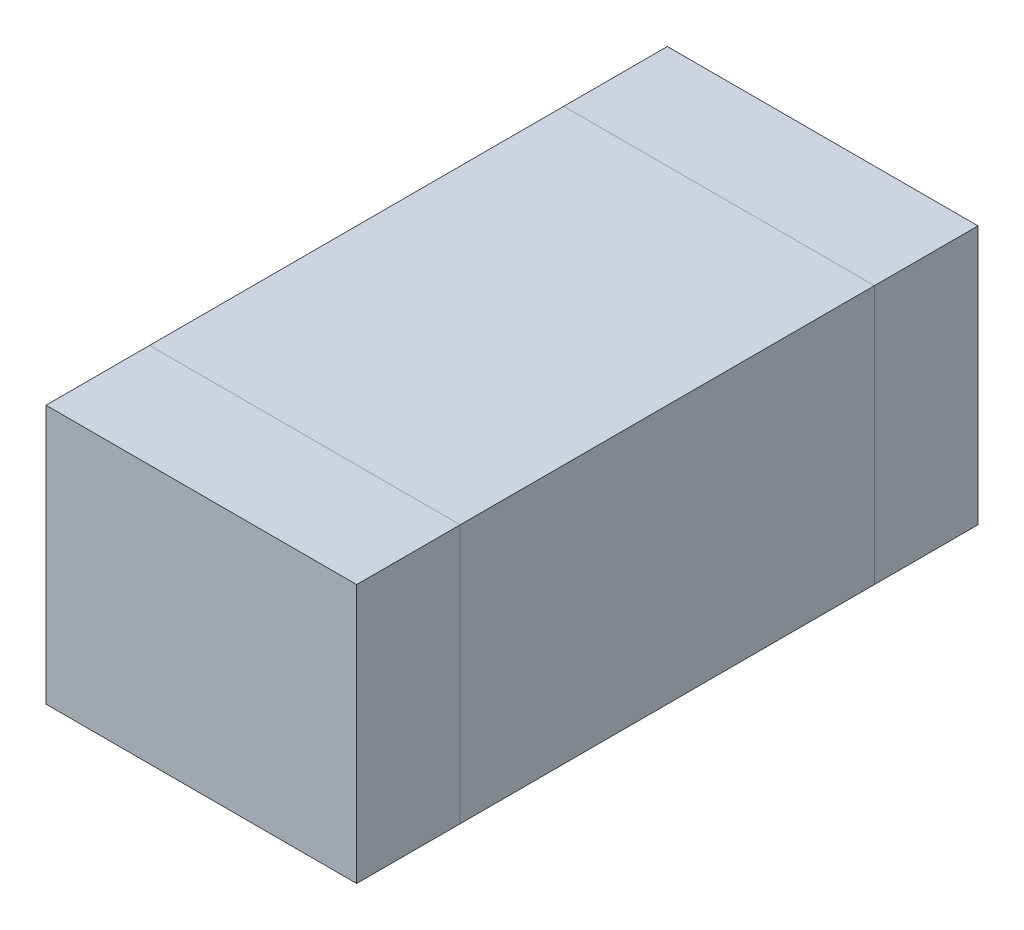
ISO-10303-21;
HEADER;
FILE_DESCRIPTION(('STEP AP214'),'2;1');
FILE_NAME('part.step','',(''),(''),'','','');
FILE_SCHEMA(('AUTOMOTIVE_DESIGN { 1 0 10303 214 1 1 1 1 }'));
ENDSEC;
DATA;
#1=APPLICATION_CONTEXT('core data for automotive mechanical design processes');
#2=APPLICATION_PROTOCOL_DEFINITION('international standard','automotive_design',2000,#1);
#3=PRODUCT_CONTEXT('',#1,'mechanical');
#4=PRODUCT('Part','Part','',(#3));
#5=PRODUCT_RELATED_PRODUCT_CATEGORY('part','',(#4));
#6=PRODUCT_DEFINITION_FORMATION('','',#4);
#7=PRODUCT_DEFINITION_CONTEXT('part definition',#1,'design');
#8=PRODUCT_DEFINITION('design','',#6,#7);
#9=PRODUCT_DEFINITION_SHAPE('','',#8);
#10=(LENGTH_UNIT() NAMED_UNIT(*) SI_UNIT(.MILLI.,.METRE.));
#11=(NAMED_UNIT(*) PLANE_ANGLE_UNIT() SI_UNIT($,.RADIAN.));
#12=(NAMED_UNIT(*) SI_UNIT($,.STERADIAN.) SOLID_ANGLE_UNIT());
#13=UNCERTAINTY_MEASURE_WITH_UNIT(LENGTH_MEASURE(1.E-05),#10,'distance_accuracy_value','');
#14=(GEOMETRIC_REPRESENTATION_CONTEXT(3) GLOBAL_UNCERTAINTY_ASSIGNED_CONTEXT((#13)) GLOBAL_UNIT_ASSIGNED_CONTEXT((#10,
#11,#12)) REPRESENTATION_CONTEXT('',''));
#15=CARTESIAN_POINT('',(0.,0.,0.));
#16=DIRECTION('',(0.,0.,1.));
#17=DIRECTION('',(1.,0.,0.));
#18=AXIS2_PLACEMENT_3D('',#15,#16,#17);
#19=CARTESIAN_POINT('',(-0.15,0.566227766016838,0.3));
#20=DIRECTION('',(0.,0.,1.));
#21=DIRECTION('',(1.,0.,0.));
#22=AXIS2_PLACEMENT_3D('',#19,#20,#21);
#23=PLANE('',#22);
#24=DIRECTION('',(0.,1.,0.));
#25=VECTOR('',#24,1.);
#26=CARTESIAN_POINT('',(-0.15,0.566227766016838,0.3));
#27=LINE('',#26,#25);
#28=CARTESIAN_POINT('',(-0.15,0.,0.3));
#29=VERTEX_POINT('',#28);
#30=CARTESIAN_POINT('',(-0.15,0.25,0.3));
#31=VERTEX_POINT('',#30);
#32=EDGE_CURVE('P0_E20',#29,#31,#27,.T.);
#33=ORIENTED_EDGE('',*,*,#32,.F.);
#34=DIRECTION('',(1.,0.,0.));
#35=VECTOR('',#34,1.);
#36=CARTESIAN_POINT('',(0.,0.,0.3));
#37=LINE('',#36,#35);
#38=CARTESIAN_POINT('',(0.15,0.,0.3));
#39=VERTEX_POINT('',#38);
#40=EDGE_CURVE('P0_E79',#29,#39,#37,.T.);
#41=ORIENTED_EDGE('',*,*,#40,.T.);
#42=DIRECTION('',(0.,1.,0.));
#43=VECTOR('',#42,1.);
#44=CARTESIAN_POINT('',(0.15,0.566227766016838,0.3));
#45=LINE('',#44,#43);
#46=CARTESIAN_POINT('',(0.15,0.25,0.3));
#47=VERTEX_POINT('',#46);
#48=EDGE_CURVE('P0_E68',#47,#39,#45,.F.);
#49=ORIENTED_EDGE('',*,*,#48,.F.);
#50=DIRECTION('',(1.,0.,0.));
#51=VECTOR('',#50,1.);
#52=CARTESIAN_POINT('',(0.,0.25,0.3));
#53=LINE('',#52,#51);
#54=EDGE_CURVE('P0_E56',#31,#47,#53,.T.);
#55=ORIENTED_EDGE('',*,*,#54,.F.);
#56=EDGE_LOOP('',(#33,#41,#49,#55));
#57=FACE_BOUND('',#56,.T.);
#58=ADVANCED_FACE('P0_F17',(#57),#23,.T.);
#59=CARTESIAN_POINT('',(-0.15,0.566227766016838,0.2));
#60=DIRECTION('',(-1.,0.,0.));
#61=DIRECTION('',(0.,0.,1.));
#62=AXIS2_PLACEMENT_3D('',#59,#60,#61);
#63=PLANE('',#62);
#64=DIRECTION('',(0.,1.,0.));
#65=VECTOR('',#64,1.);
#66=CARTESIAN_POINT('',(-0.15,0.566227766016838,0.2));
#67=LINE('',#66,#65);
#68=CARTESIAN_POINT('',(-0.15,0.,0.2));
#69=VERTEX_POINT('',#68);
#70=CARTESIAN_POINT('',(-0.15,0.25,0.2));
#71=VERTEX_POINT('',#70);
#72=EDGE_CURVE('P0_E83',#69,#71,#67,.T.);
#73=ORIENTED_EDGE('',*,*,#72,.F.);
#74=DIRECTION('',(0.,0.,1.));
#75=VECTOR('',#74,1.);
#76=CARTESIAN_POINT('',(-0.15,0.,0.));
#77=LINE('',#76,#75);
#78=EDGE_CURVE('P0_E65',#69,#29,#77,.T.);
#79=ORIENTED_EDGE('',*,*,#78,.T.);
#80=ORIENTED_EDGE('',*,*,#32,.T.);
#81=DIRECTION('',(0.,0.,1.));
#82=VECTOR('',#81,1.);
#83=CARTESIAN_POINT('',(-0.15,0.25,0.));
#84=LINE('',#83,#82);
#85=EDGE_CURVE('P0_E62',#71,#31,#84,.T.);
#86=ORIENTED_EDGE('',*,*,#85,.F.);
#87=EDGE_LOOP('',(#73,#79,#80,#86));
#88=FACE_BOUND('',#87,.T.);
#89=ADVANCED_FACE('P0_F61',(#88),#63,.T.);
#90=CARTESIAN_POINT('',(0.,0.25,0.));
#91=DIRECTION('',(0.,1.,0.));
#92=DIRECTION('',(0.,0.,1.));
#93=AXIS2_PLACEMENT_3D('',#90,#91,#92);
#94=PLANE('',#93);
#95=DIRECTION('',(0.,0.,-1.));
#96=VECTOR('',#95,1.);
#97=CARTESIAN_POINT('',(0.15,0.25,0.2));
#98=LINE('',#97,#96);
#99=CARTESIAN_POINT('',(0.15,0.25,0.2));
#100=VERTEX_POINT('',#99);
#101=EDGE_CURVE('P0_E70',#100,#47,#98,.F.);
#102=ORIENTED_EDGE('',*,*,#101,.F.);
#103=DIRECTION('',(-1.,0.,0.));
#104=VECTOR('',#103,1.);
#105=CARTESIAN_POINT('',(-0.15,0.25,0.2));
#106=LINE('',#105,#104);
#107=EDGE_CURVE('P0_E74',#71,#100,#106,.F.);
#108=ORIENTED_EDGE('',*,*,#107,.F.);
#109=ORIENTED_EDGE('',*,*,#85,.T.);
#110=ORIENTED_EDGE('',*,*,#54,.T.);
#111=EDGE_LOOP('',(#102,#108,#109,#110));
#112=FACE_BOUND('',#111,.T.);
#113=ADVANCED_FACE('P0_F72',(#112),#94,.T.);
#114=CARTESIAN_POINT('',(0.15,0.566227766016838,0.2));
#115=DIRECTION('',(1.,0.,0.));
#116=DIRECTION('',(0.,0.,-1.));
#117=AXIS2_PLACEMENT_3D('',#114,#115,#116);
#118=PLANE('',#117);
#119=ORIENTED_EDGE('',*,*,#48,.T.);
#120=DIRECTION('',(0.,0.,1.));
#121=VECTOR('',#120,1.);
#122=CARTESIAN_POINT('',(0.15,0.,0.));
#123=LINE('',#122,#121);
#124=CARTESIAN_POINT('',(0.15,0.,0.2));
#125=VERTEX_POINT('',#124);
#126=EDGE_CURVE('P0_E35',#39,#125,#123,.F.);
#127=ORIENTED_EDGE('',*,*,#126,.T.);
#128=DIRECTION('',(0.,1.,0.));
#129=VECTOR('',#128,1.);
#130=CARTESIAN_POINT('',(0.15,0.566227766016838,0.2));
#131=LINE('',#130,#129);
#132=EDGE_CURVE('P0_E26',#100,#125,#131,.F.);
#133=ORIENTED_EDGE('',*,*,#132,.F.);
#134=ORIENTED_EDGE('',*,*,#101,.T.);
#135=EDGE_LOOP('',(#119,#127,#133,#134));
#136=FACE_BOUND('',#135,.T.);
#137=ADVANCED_FACE('P0_F89',(#136),#118,.T.);
#138=CARTESIAN_POINT('',(0.,0.,0.));
#139=DIRECTION('',(0.,1.,0.));
#140=DIRECTION('',(0.,0.,1.));
#141=AXIS2_PLACEMENT_3D('',#138,#139,#140);
#142=PLANE('',#141);
#143=DIRECTION('',(-1.,0.,0.));
#144=VECTOR('',#143,1.);
#145=CARTESIAN_POINT('',(-0.15,0.,0.2));
#146=LINE('',#145,#144);
#147=EDGE_CURVE('P0_E11',#125,#69,#146,.T.);
#148=ORIENTED_EDGE('',*,*,#147,.F.);
#149=ORIENTED_EDGE('',*,*,#126,.F.);
#150=ORIENTED_EDGE('',*,*,#40,.F.);
#151=ORIENTED_EDGE('',*,*,#78,.F.);
#152=EDGE_LOOP('',(#148,#149,#150,#151));
#153=FACE_BOUND('',#152,.T.);
#154=ADVANCED_FACE('P0_F91',(#153),#142,.F.);
#155=CARTESIAN_POINT('',(-0.15,0.566227766016838,0.2));
#156=DIRECTION('',(0.,0.,-1.));
#157=DIRECTION('',(-1.,0.,0.));
#158=AXIS2_PLACEMENT_3D('',#155,#156,#157);
#159=PLANE('',#158);
#160=ORIENTED_EDGE('',*,*,#132,.T.);
#161=ORIENTED_EDGE('',*,*,#147,.T.);
#162=ORIENTED_EDGE('',*,*,#72,.T.);
#163=ORIENTED_EDGE('',*,*,#107,.T.);
#164=EDGE_LOOP('',(#160,#161,#162,#163));
#165=FACE_BOUND('',#164,.T.);
#166=ADVANCED_FACE('P0_F88',(#165),#159,.T.);
#167=CLOSED_SHELL('',(#58,#89,#113,#137,#154,#166));
#168=MANIFOLD_SOLID_BREP('P0_B1',#167);
#169=CARTESIAN_POINT('',(0.,0.,0.));
#170=DIRECTION('',(0.,1.,0.));
#171=DIRECTION('',(0.,0.,1.));
#172=AXIS2_PLACEMENT_3D('',#169,#170,#171);
#173=PLANE('',#172);
#174=DIRECTION('',(-1.,0.,0.));
#175=VECTOR('',#174,1.);
#176=CARTESIAN_POINT('',(-0.15,0.,0.2));
#177=LINE('',#176,#175);
#178=CARTESIAN_POINT('',(0.15,0.,0.2));
#179=VERTEX_POINT('',#178);
#180=CARTESIAN_POINT('',(-0.15,0.,0.2));
#181=VERTEX_POINT('',#180);
#182=EDGE_CURVE('P1_E81',#179,#181,#177,.T.);
#183=ORIENTED_EDGE('',*,*,#182,.T.);
#184=DIRECTION('',(0.,0.,-1.));
#185=VECTOR('',#184,1.);
#186=CARTESIAN_POINT('',(-0.15,0.,-0.2));
#187=LINE('',#186,#185);
#188=CARTESIAN_POINT('',(-0.15,0.,-0.2));
#189=VERTEX_POINT('',#188);
#190=EDGE_CURVE('P1_E68',#181,#189,#187,.T.);
#191=ORIENTED_EDGE('',*,*,#190,.T.);
#192=DIRECTION('',(1.,0.,0.));
#193=VECTOR('',#192,1.);
#194=CARTESIAN_POINT('',(-0.15,0.,-0.2));
#195=LINE('',#194,#193);
#196=CARTESIAN_POINT('',(0.15,0.,-0.2));
#197=VERTEX_POINT('',#196);
#198=EDGE_CURVE('P1_E55',#189,#197,#195,.T.);
#199=ORIENTED_EDGE('',*,*,#198,.T.);
#200=DIRECTION('',(0.,0.,1.));
#201=VECTOR('',#200,1.);
#202=CARTESIAN_POINT('',(0.15,0.,-0.2));
#203=LINE('',#202,#201);
#204=EDGE_CURVE('P1_E20',#197,#179,#203,.T.);
#205=ORIENTED_EDGE('',*,*,#204,.T.);
#206=EDGE_LOOP('',(#183,#191,#199,#205));
#207=FACE_BOUND('',#206,.T.);
#208=ADVANCED_FACE('P1_F17',(#207),#173,.F.);
#209=CARTESIAN_POINT('',(0.15,0.25,-0.2));
#210=DIRECTION('',(-1.,0.,0.));
#211=DIRECTION('',(0.,0.,1.));
#212=AXIS2_PLACEMENT_3D('',#209,#210,#211);
#213=PLANE('',#212);
#214=DIRECTION('',(0.,1.,0.));
#215=VECTOR('',#214,1.);
#216=CARTESIAN_POINT('',(0.15,0.25,-0.2));
#217=LINE('',#216,#215);
#218=CARTESIAN_POINT('',(0.15,0.25,-0.2));
#219=VERTEX_POINT('',#218);
#220=EDGE_CURVE('P1_E61',#197,#219,#217,.T.);
#221=ORIENTED_EDGE('',*,*,#220,.T.);
#222=DIRECTION('',(0.,0.,1.));
#223=VECTOR('',#222,1.);
#224=CARTESIAN_POINT('',(0.15,0.25,0.));
#225=LINE('',#224,#223);
#226=CARTESIAN_POINT('',(0.15,0.25,0.2));
#227=VERTEX_POINT('',#226);
#228=EDGE_CURVE('P1_E83',#227,#219,#225,.F.);
#229=ORIENTED_EDGE('',*,*,#228,.F.);
#230=DIRECTION('',(0.,1.,0.));
#231=VECTOR('',#230,1.);
#232=CARTESIAN_POINT('',(0.15,0.25,0.2));
#233=LINE('',#232,#231);
#234=EDGE_CURVE('P1_E64',#227,#179,#233,.F.);
#235=ORIENTED_EDGE('',*,*,#234,.T.);
#236=ORIENTED_EDGE('',*,*,#204,.F.);
#237=EDGE_LOOP('',(#221,#229,#235,#236));
#238=FACE_BOUND('',#237,.T.);
#239=ADVANCED_FACE('P1_F60',(#238),#213,.F.);
#240=CARTESIAN_POINT('',(-0.15,0.25,-0.2));
#241=DIRECTION('',(0.,0.,1.));
#242=DIRECTION('',(1.,0.,0.));
#243=AXIS2_PLACEMENT_3D('',#240,#241,#242);
#244=PLANE('',#243);
#245=DIRECTION('',(0.,1.,0.));
#246=VECTOR('',#245,1.);
#247=CARTESIAN_POINT('',(-0.15,0.25,-0.2));
#248=LINE('',#247,#246);
#249=CARTESIAN_POINT('',(-0.15,0.25,-0.2));
#250=VERTEX_POINT('',#249);
#251=EDGE_CURVE('P1_E70',#189,#250,#248,.T.);
#252=ORIENTED_EDGE('',*,*,#251,.T.);
#253=DIRECTION('',(1.,0.,0.));
#254=VECTOR('',#253,1.);
#255=CARTESIAN_POINT('',(0.,0.25,-0.2));
#256=LINE('',#255,#254);
#257=EDGE_CURVE('P1_E74',#219,#250,#256,.F.);
#258=ORIENTED_EDGE('',*,*,#257,.F.);
#259=ORIENTED_EDGE('',*,*,#220,.F.);
#260=ORIENTED_EDGE('',*,*,#198,.F.);
#261=EDGE_LOOP('',(#252,#258,#259,#260));
#262=FACE_BOUND('',#261,.T.);
#263=ADVANCED_FACE('P1_F72',(#262),#244,.F.);
#264=CARTESIAN_POINT('',(-0.15,0.25,-0.2));
#265=DIRECTION('',(1.,0.,0.));
#266=DIRECTION('',(0.,0.,-1.));
#267=AXIS2_PLACEMENT_3D('',#264,#265,#266);
#268=PLANE('',#267);
#269=DIRECTION('',(0.,1.,0.));
#270=VECTOR('',#269,1.);
#271=CARTESIAN_POINT('',(-0.15,0.25,0.2));
#272=LINE('',#271,#270);
#273=CARTESIAN_POINT('',(-0.15,0.25,0.2));
#274=VERTEX_POINT('',#273);
#275=EDGE_CURVE('P1_E35',#181,#274,#272,.T.);
#276=ORIENTED_EDGE('',*,*,#275,.T.);
#277=DIRECTION('',(0.,0.,1.));
#278=VECTOR('',#277,1.);
#279=CARTESIAN_POINT('',(-0.15,0.25,0.));
#280=LINE('',#279,#278);
#281=EDGE_CURVE('P1_E26',#250,#274,#280,.T.);
#282=ORIENTED_EDGE('',*,*,#281,.F.);
#283=ORIENTED_EDGE('',*,*,#251,.F.);
#284=ORIENTED_EDGE('',*,*,#190,.F.);
#285=EDGE_LOOP('',(#276,#282,#283,#284));
#286=FACE_BOUND('',#285,.T.);
#287=ADVANCED_FACE('P1_F89',(#286),#268,.F.);
#288=CARTESIAN_POINT('',(-0.15,0.25,0.2));
#289=DIRECTION('',(0.,0.,-1.));
#290=DIRECTION('',(-1.,0.,0.));
#291=AXIS2_PLACEMENT_3D('',#288,#289,#290);
#292=PLANE('',#291);
#293=ORIENTED_EDGE('',*,*,#234,.F.);
#294=DIRECTION('',(1.,0.,0.));
#295=VECTOR('',#294,1.);
#296=CARTESIAN_POINT('',(0.,0.25,0.2));
#297=LINE('',#296,#295);
#298=EDGE_CURVE('P1_E11',#274,#227,#297,.T.);
#299=ORIENTED_EDGE('',*,*,#298,.F.);
#300=ORIENTED_EDGE('',*,*,#275,.F.);
#301=ORIENTED_EDGE('',*,*,#182,.F.);
#302=EDGE_LOOP('',(#293,#299,#300,#301));
#303=FACE_BOUND('',#302,.T.);
#304=ADVANCED_FACE('P1_F91',(#303),#292,.F.);
#305=CARTESIAN_POINT('',(0.,0.25,0.));
#306=DIRECTION('',(0.,1.,0.));
#307=DIRECTION('',(0.,0.,1.));
#308=AXIS2_PLACEMENT_3D('',#305,#306,#307);
#309=PLANE('',#308);
#310=ORIENTED_EDGE('',*,*,#281,.T.);
#311=ORIENTED_EDGE('',*,*,#298,.T.);
#312=ORIENTED_EDGE('',*,*,#228,.T.);
#313=ORIENTED_EDGE('',*,*,#257,.T.);
#314=EDGE_LOOP('',(#310,#311,#312,#313));
#315=FACE_BOUND('',#314,.T.);
#316=ADVANCED_FACE('P1_F88',(#315),#309,.T.);
#317=CLOSED_SHELL('',(#208,#239,#263,#287,#304,#316));
#318=MANIFOLD_SOLID_BREP('P1_B1',#317);
#319=CARTESIAN_POINT('',(-0.15,0.566227766016838,-0.2));
#320=DIRECTION('',(0.,0.,1.));
#321=DIRECTION('',(1.,0.,0.));
#322=AXIS2_PLACEMENT_3D('',#319,#320,#321);
#323=PLANE('',#322);
#324=DIRECTION('',(0.,1.,0.));
#325=VECTOR('',#324,1.);
#326=CARTESIAN_POINT('',(-0.15,0.566227766016838,-0.2));
#327=LINE('',#326,#325);
#328=CARTESIAN_POINT('',(-0.15,0.,-0.2));
#329=VERTEX_POINT('',#328);
#330=CARTESIAN_POINT('',(-0.15,0.25,-0.2));
#331=VERTEX_POINT('',#330);
#332=EDGE_CURVE('P2_E20',#329,#331,#327,.T.);
#333=ORIENTED_EDGE('',*,*,#332,.F.);
#334=DIRECTION('',(1.,0.,0.));
#335=VECTOR('',#334,1.);
#336=CARTESIAN_POINT('',(0.,0.,-0.2));
#337=LINE('',#336,#335);
#338=CARTESIAN_POINT('',(0.15,0.,-0.2));
#339=VERTEX_POINT('',#338);
#340=EDGE_CURVE('P2_E81',#339,#329,#337,.F.);
#341=ORIENTED_EDGE('',*,*,#340,.F.);
#342=DIRECTION('',(0.,1.,0.));
#343=VECTOR('',#342,1.);
#344=CARTESIAN_POINT('',(0.15,0.566227766016838,-0.2));
#345=LINE('',#344,#343);
#346=CARTESIAN_POINT('',(0.15,0.25,-0.2));
#347=VERTEX_POINT('',#346);
#348=EDGE_CURVE('P2_E68',#347,#339,#345,.F.);
#349=ORIENTED_EDGE('',*,*,#348,.F.);
#350=DIRECTION('',(1.,0.,0.));
#351=VECTOR('',#350,1.);
#352=CARTESIAN_POINT('',(0.,0.25,-0.2));
#353=LINE('',#352,#351);
#354=EDGE_CURVE('P2_E55',#331,#347,#353,.T.);
#355=ORIENTED_EDGE('',*,*,#354,.F.);
#356=EDGE_LOOP('',(#333,#341,#349,#355));
#357=FACE_BOUND('',#356,.T.);
#358=ADVANCED_FACE('P2_F17',(#357),#323,.T.);
#359=CARTESIAN_POINT('',(-0.15,0.566227766016838,-0.2));
#360=DIRECTION('',(-1.,0.,0.));
#361=DIRECTION('',(0.,0.,1.));
#362=AXIS2_PLACEMENT_3D('',#359,#360,#361);
#363=PLANE('',#362);
#364=DIRECTION('',(0.,1.,0.));
#365=VECTOR('',#364,1.);
#366=CARTESIAN_POINT('',(-0.15,0.566227766016838,-0.3));
#367=LINE('',#366,#365);
#368=CARTESIAN_POINT('',(-0.15,0.,-0.3));
#369=VERTEX_POINT('',#368);
#370=CARTESIAN_POINT('',(-0.15,0.25,-0.3));
#371=VERTEX_POINT('',#370);
#372=EDGE_CURVE('P2_E83',#369,#371,#367,.T.);
#373=ORIENTED_EDGE('',*,*,#372,.F.);
#374=DIRECTION('',(0.,0.,-1.));
#375=VECTOR('',#374,1.);
#376=CARTESIAN_POINT('',(-0.15,0.,0.));
#377=LINE('',#376,#375);
#378=EDGE_CURVE('P2_E64',#329,#369,#377,.T.);
#379=ORIENTED_EDGE('',*,*,#378,.F.);
#380=ORIENTED_EDGE('',*,*,#332,.T.);
#381=DIRECTION('',(0.,0.,1.));
#382=VECTOR('',#381,1.);
#383=CARTESIAN_POINT('',(-0.15,0.25,0.));
#384=LINE('',#383,#382);
#385=EDGE_CURVE('P2_E61',#371,#331,#384,.T.);
#386=ORIENTED_EDGE('',*,*,#385,.F.);
#387=EDGE_LOOP('',(#373,#379,#380,#386));
#388=FACE_BOUND('',#387,.T.);
#389=ADVANCED_FACE('P2_F60',(#388),#363,.T.);
#390=CARTESIAN_POINT('',(0.,0.25,0.));
#391=DIRECTION('',(0.,1.,0.));
#392=DIRECTION('',(0.,0.,1.));
#393=AXIS2_PLACEMENT_3D('',#390,#391,#392);
#394=PLANE('',#393);
#395=DIRECTION('',(0.,0.,-1.));
#396=VECTOR('',#395,1.);
#397=CARTESIAN_POINT('',(0.15,0.25,-0.2));
#398=LINE('',#397,#396);
#399=CARTESIAN_POINT('',(0.15,0.25,-0.3));
#400=VERTEX_POINT('',#399);
#401=EDGE_CURVE('P2_E70',#400,#347,#398,.F.);
#402=ORIENTED_EDGE('',*,*,#401,.F.);
#403=DIRECTION('',(-1.,0.,0.));
#404=VECTOR('',#403,1.);
#405=CARTESIAN_POINT('',(-0.15,0.25,-0.3));
#406=LINE('',#405,#404);
#407=EDGE_CURVE('P2_E74',#371,#400,#406,.F.);
#408=ORIENTED_EDGE('',*,*,#407,.F.);
#409=ORIENTED_EDGE('',*,*,#385,.T.);
#410=ORIENTED_EDGE('',*,*,#354,.T.);
#411=EDGE_LOOP('',(#402,#408,#409,#410));
#412=FACE_BOUND('',#411,.T.);
#413=ADVANCED_FACE('P2_F72',(#412),#394,.T.);
#414=CARTESIAN_POINT('',(0.15,0.566227766016838,-0.2));
#415=DIRECTION('',(1.,0.,0.));
#416=DIRECTION('',(0.,0.,-1.));
#417=AXIS2_PLACEMENT_3D('',#414,#415,#416);
#418=PLANE('',#417);
#419=ORIENTED_EDGE('',*,*,#348,.T.);
#420=DIRECTION('',(0.,0.,-1.));
#421=VECTOR('',#420,1.);
#422=CARTESIAN_POINT('',(0.15,0.,0.));
#423=LINE('',#422,#421);
#424=CARTESIAN_POINT('',(0.15,0.,-0.3));
#425=VERTEX_POINT('',#424);
#426=EDGE_CURVE('P2_E35',#425,#339,#423,.F.);
#427=ORIENTED_EDGE('',*,*,#426,.F.);
#428=DIRECTION('',(0.,1.,0.));
#429=VECTOR('',#428,1.);
#430=CARTESIAN_POINT('',(0.15,0.566227766016838,-0.3));
#431=LINE('',#430,#429);
#432=EDGE_CURVE('P2_E26',#400,#425,#431,.F.);
#433=ORIENTED_EDGE('',*,*,#432,.F.);
#434=ORIENTED_EDGE('',*,*,#401,.T.);
#435=EDGE_LOOP('',(#419,#427,#433,#434));
#436=FACE_BOUND('',#435,.T.);
#437=ADVANCED_FACE('P2_F89',(#436),#418,.T.);
#438=CARTESIAN_POINT('',(0.,0.,0.));
#439=DIRECTION('',(0.,-1.,0.));
#440=DIRECTION('',(0.,0.,-1.));
#441=AXIS2_PLACEMENT_3D('',#438,#439,#440);
#442=PLANE('',#441);
#443=ORIENTED_EDGE('',*,*,#426,.T.);
#444=ORIENTED_EDGE('',*,*,#340,.T.);
#445=ORIENTED_EDGE('',*,*,#378,.T.);
#446=DIRECTION('',(-1.,0.,0.));
#447=VECTOR('',#446,1.);
#448=CARTESIAN_POINT('',(-0.15,0.,-0.3));
#449=LINE('',#448,#447);
#450=EDGE_CURVE('P2_E11',#425,#369,#449,.T.);
#451=ORIENTED_EDGE('',*,*,#450,.F.);
#452=EDGE_LOOP('',(#443,#444,#445,#451));
#453=FACE_BOUND('',#452,.T.);
#454=ADVANCED_FACE('P2_F91',(#453),#442,.T.);
#455=CARTESIAN_POINT('',(-0.15,0.566227766016838,-0.3));
#456=DIRECTION('',(0.,0.,-1.));
#457=DIRECTION('',(-1.,0.,0.));
#458=AXIS2_PLACEMENT_3D('',#455,#456,#457);
#459=PLANE('',#458);
#460=ORIENTED_EDGE('',*,*,#432,.T.);
#461=ORIENTED_EDGE('',*,*,#450,.T.);
#462=ORIENTED_EDGE('',*,*,#372,.T.);
#463=ORIENTED_EDGE('',*,*,#407,.T.);
#464=EDGE_LOOP('',(#460,#461,#462,#463));
#465=FACE_BOUND('',#464,.T.);
#466=ADVANCED_FACE('P2_F88',(#465),#459,.T.);
#467=CLOSED_SHELL('',(#358,#389,#413,#437,#454,#466));
#468=MANIFOLD_SOLID_BREP('P2_B1',#467);
#469=ADVANCED_BREP_SHAPE_REPRESENTATION('',(#18,#168,#318,#468),#14);
#470=SHAPE_DEFINITION_REPRESENTATION(#9,#469);
ENDSEC;
END-ISO-10303-21;
